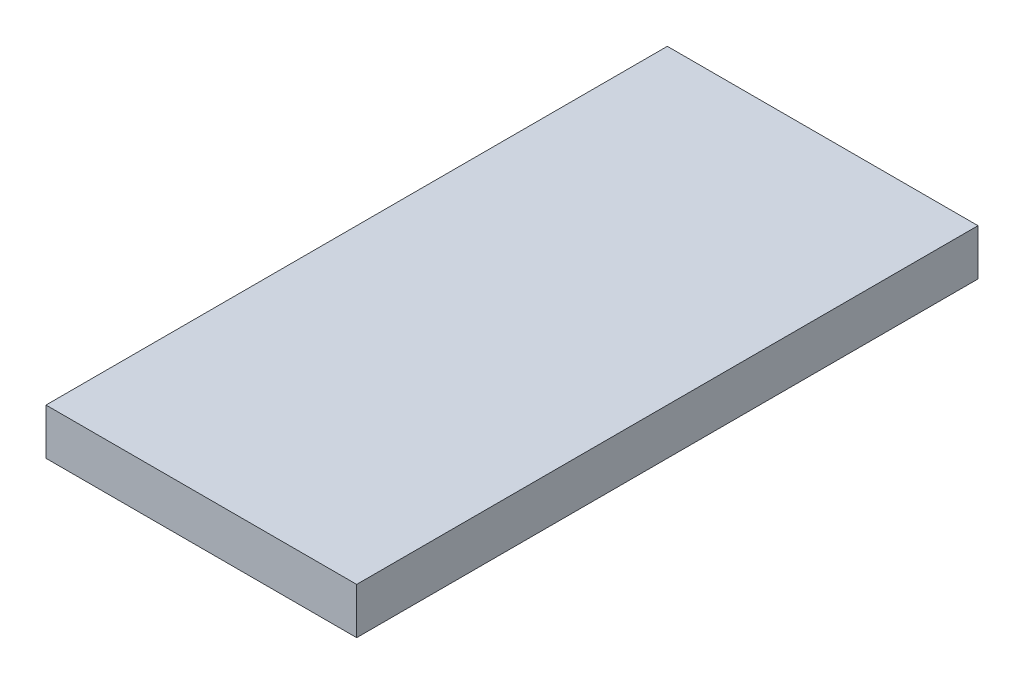
ISO-10303-21;
HEADER;
FILE_DESCRIPTION(('STEP AP214'),'2;1');
FILE_NAME('part.step','',(''),(''),'','','');
FILE_SCHEMA(('AUTOMOTIVE_DESIGN { 1 0 10303 214 1 1 1 1 }'));
ENDSEC;
DATA;
#1=APPLICATION_CONTEXT('core data for automotive mechanical design processes');
#2=APPLICATION_PROTOCOL_DEFINITION('international standard','automotive_design',2000,#1);
#3=PRODUCT_CONTEXT('',#1,'mechanical');
#4=PRODUCT('Part','Part','',(#3));
#5=PRODUCT_RELATED_PRODUCT_CATEGORY('part','',(#4));
#6=PRODUCT_DEFINITION_FORMATION('','',#4);
#7=PRODUCT_DEFINITION_CONTEXT('part definition',#1,'design');
#8=PRODUCT_DEFINITION('design','',#6,#7);
#9=PRODUCT_DEFINITION_SHAPE('','',#8);
#10=(LENGTH_UNIT() NAMED_UNIT(*) SI_UNIT(.MILLI.,.METRE.));
#11=(NAMED_UNIT(*) PLANE_ANGLE_UNIT() SI_UNIT($,.RADIAN.));
#12=(NAMED_UNIT(*) SI_UNIT($,.STERADIAN.) SOLID_ANGLE_UNIT());
#13=UNCERTAINTY_MEASURE_WITH_UNIT(LENGTH_MEASURE(1.E-05),#10,'distance_accuracy_value','');
#14=(GEOMETRIC_REPRESENTATION_CONTEXT(3) GLOBAL_UNCERTAINTY_ASSIGNED_CONTEXT((#13)) GLOBAL_UNIT_ASSIGNED_CONTEXT((#10,
#11,#12)) REPRESENTATION_CONTEXT('',''));
#15=CARTESIAN_POINT('',(0.,0.,0.));
#16=DIRECTION('',(0.,0.,1.));
#17=DIRECTION('',(1.,0.,0.));
#18=AXIS2_PLACEMENT_3D('',#15,#16,#17);
#19=CARTESIAN_POINT('',(0.,14.86,0.));
#20=DIRECTION('',(1.,0.,0.));
#21=DIRECTION('',(0.,0.,-1.));
#22=AXIS2_PLACEMENT_3D('',#19,#20,#21);
#23=PLANE('',#22);
#24=DIRECTION('',(0.,0.,1.));
#25=VECTOR('',#24,1.);
#26=CARTESIAN_POINT('',(0.,0.,0.));
#27=LINE('',#26,#25);
#28=CARTESIAN_POINT('',(0.,0.,0.));
#29=VERTEX_POINT('',#28);
#30=CARTESIAN_POINT('',(0.,0.,200.));
#31=VERTEX_POINT('',#30);
#32=EDGE_CURVE('E98',#29,#31,#27,.T.);
#33=ORIENTED_EDGE('',*,*,#32,.T.);
#34=DIRECTION('',(0.,-1.,0.));
#35=VECTOR('',#34,1.);
#36=CARTESIAN_POINT('',(0.,14.86,200.));
#37=LINE('',#36,#35);
#38=CARTESIAN_POINT('',(0.,14.86,200.));
#39=VERTEX_POINT('',#38);
#40=EDGE_CURVE('E11',#39,#31,#37,.T.);
#41=ORIENTED_EDGE('',*,*,#40,.F.);
#42=DIRECTION('',(0.,0.,1.));
#43=VECTOR('',#42,1.);
#44=CARTESIAN_POINT('',(0.,14.86,0.));
#45=LINE('',#44,#43);
#46=CARTESIAN_POINT('',(0.,14.86,0.));
#47=VERTEX_POINT('',#46);
#48=EDGE_CURVE('E86',#47,#39,#45,.T.);
#49=ORIENTED_EDGE('',*,*,#48,.F.);
#50=DIRECTION('',(0.,-1.,0.));
#51=VECTOR('',#50,1.);
#52=CARTESIAN_POINT('',(0.,14.86,0.));
#53=LINE('',#52,#51);
#54=EDGE_CURVE('E94',#47,#29,#53,.T.);
#55=ORIENTED_EDGE('',*,*,#54,.T.);
#56=EDGE_LOOP('',(#33,#41,#49,#55));
#57=FACE_BOUND('',#56,.T.);
#58=ADVANCED_FACE('F35',(#57),#23,.F.);
#59=CARTESIAN_POINT('',(0.,14.86,200.));
#60=DIRECTION('',(0.,0.,-1.));
#61=DIRECTION('',(-1.,0.,0.));
#62=AXIS2_PLACEMENT_3D('',#59,#60,#61);
#63=PLANE('',#62);
#64=DIRECTION('',(1.,0.,0.));
#65=VECTOR('',#64,1.);
#66=CARTESIAN_POINT('',(0.,0.,200.));
#67=LINE('',#66,#65);
#68=CARTESIAN_POINT('',(100.,0.,200.));
#69=VERTEX_POINT('',#68);
#70=EDGE_CURVE('E90',#31,#69,#67,.T.);
#71=ORIENTED_EDGE('',*,*,#70,.T.);
#72=DIRECTION('',(0.,-1.,0.));
#73=VECTOR('',#72,1.);
#74=CARTESIAN_POINT('',(100.,14.86,200.));
#75=LINE('',#74,#73);
#76=CARTESIAN_POINT('',(100.,14.86,200.));
#77=VERTEX_POINT('',#76);
#78=EDGE_CURVE('E43',#77,#69,#75,.T.);
#79=ORIENTED_EDGE('',*,*,#78,.F.);
#80=DIRECTION('',(1.,0.,0.));
#81=VECTOR('',#80,1.);
#82=CARTESIAN_POINT('',(0.,14.86,200.));
#83=LINE('',#82,#81);
#84=EDGE_CURVE('E81',#39,#77,#83,.T.);
#85=ORIENTED_EDGE('',*,*,#84,.F.);
#86=ORIENTED_EDGE('',*,*,#40,.T.);
#87=EDGE_LOOP('',(#71,#79,#85,#86));
#88=FACE_BOUND('',#87,.T.);
#89=ADVANCED_FACE('F89',(#88),#63,.F.);
#90=CARTESIAN_POINT('',(100.,14.86,0.));
#91=DIRECTION('',(-1.,0.,0.));
#92=DIRECTION('',(0.,0.,1.));
#93=AXIS2_PLACEMENT_3D('',#90,#91,#92);
#94=PLANE('',#93);
#95=DIRECTION('',(0.,0.,-1.));
#96=VECTOR('',#95,1.);
#97=CARTESIAN_POINT('',(100.,0.,0.));
#98=LINE('',#97,#96);
#99=CARTESIAN_POINT('',(100.,0.,0.));
#100=VERTEX_POINT('',#99);
#101=EDGE_CURVE('E68',#69,#100,#98,.T.);
#102=ORIENTED_EDGE('',*,*,#101,.T.);
#103=DIRECTION('',(0.,-1.,0.));
#104=VECTOR('',#103,1.);
#105=CARTESIAN_POINT('',(100.,14.86,0.));
#106=LINE('',#105,#104);
#107=CARTESIAN_POINT('',(100.,14.86,0.));
#108=VERTEX_POINT('',#107);
#109=EDGE_CURVE('E91',#108,#100,#106,.T.);
#110=ORIENTED_EDGE('',*,*,#109,.F.);
#111=DIRECTION('',(0.,0.,-1.));
#112=VECTOR('',#111,1.);
#113=CARTESIAN_POINT('',(100.,14.86,0.));
#114=LINE('',#113,#112);
#115=EDGE_CURVE('E84',#77,#108,#114,.T.);
#116=ORIENTED_EDGE('',*,*,#115,.F.);
#117=ORIENTED_EDGE('',*,*,#78,.T.);
#118=EDGE_LOOP('',(#102,#110,#116,#117));
#119=FACE_BOUND('',#118,.T.);
#120=ADVANCED_FACE('F92',(#119),#94,.F.);
#121=CARTESIAN_POINT('',(0.,14.86,0.));
#122=DIRECTION('',(0.,0.,1.));
#123=DIRECTION('',(1.,0.,0.));
#124=AXIS2_PLACEMENT_3D('',#121,#122,#123);
#125=PLANE('',#124);
#126=DIRECTION('',(-1.,0.,0.));
#127=VECTOR('',#126,1.);
#128=CARTESIAN_POINT('',(0.,0.,0.));
#129=LINE('',#128,#127);
#130=EDGE_CURVE('E74',#100,#29,#129,.T.);
#131=ORIENTED_EDGE('',*,*,#130,.T.);
#132=ORIENTED_EDGE('',*,*,#54,.F.);
#133=DIRECTION('',(-1.,0.,0.));
#134=VECTOR('',#133,1.);
#135=CARTESIAN_POINT('',(0.,14.86,0.));
#136=LINE('',#135,#134);
#137=EDGE_CURVE('E51',#108,#47,#136,.T.);
#138=ORIENTED_EDGE('',*,*,#137,.F.);
#139=ORIENTED_EDGE('',*,*,#109,.T.);
#140=EDGE_LOOP('',(#131,#132,#138,#139));
#141=FACE_BOUND('',#140,.T.);
#142=ADVANCED_FACE('F105',(#141),#125,.F.);
#143=CARTESIAN_POINT('',(0.,14.86,0.));
#144=DIRECTION('',(0.,1.,0.));
#145=DIRECTION('',(0.,0.,1.));
#146=AXIS2_PLACEMENT_3D('',#143,#144,#145);
#147=PLANE('',#146);
#148=ORIENTED_EDGE('',*,*,#48,.T.);
#149=ORIENTED_EDGE('',*,*,#84,.T.);
#150=ORIENTED_EDGE('',*,*,#115,.T.);
#151=ORIENTED_EDGE('',*,*,#137,.T.);
#152=EDGE_LOOP('',(#148,#149,#150,#151));
#153=FACE_BOUND('',#152,.T.);
#154=ADVANCED_FACE('F82',(#153),#147,.T.);
#155=CARTESIAN_POINT('',(0.,0.,0.));
#156=DIRECTION('',(0.,1.,0.));
#157=DIRECTION('',(0.,0.,1.));
#158=AXIS2_PLACEMENT_3D('',#155,#156,#157);
#159=PLANE('',#158);
#160=ORIENTED_EDGE('',*,*,#32,.F.);
#161=ORIENTED_EDGE('',*,*,#130,.F.);
#162=ORIENTED_EDGE('',*,*,#101,.F.);
#163=ORIENTED_EDGE('',*,*,#70,.F.);
#164=EDGE_LOOP('',(#160,#161,#162,#163));
#165=FACE_BOUND('',#164,.T.);
#166=ADVANCED_FACE('F108',(#165),#159,.F.);
#167=CLOSED_SHELL('',(#58,#89,#120,#142,#154,#166));
#168=MANIFOLD_SOLID_BREP('B2',#167);
#169=ADVANCED_BREP_SHAPE_REPRESENTATION('',(#18,#168),#14);
#170=SHAPE_DEFINITION_REPRESENTATION(#9,#169);
ENDSEC;
END-ISO-10303-21;
